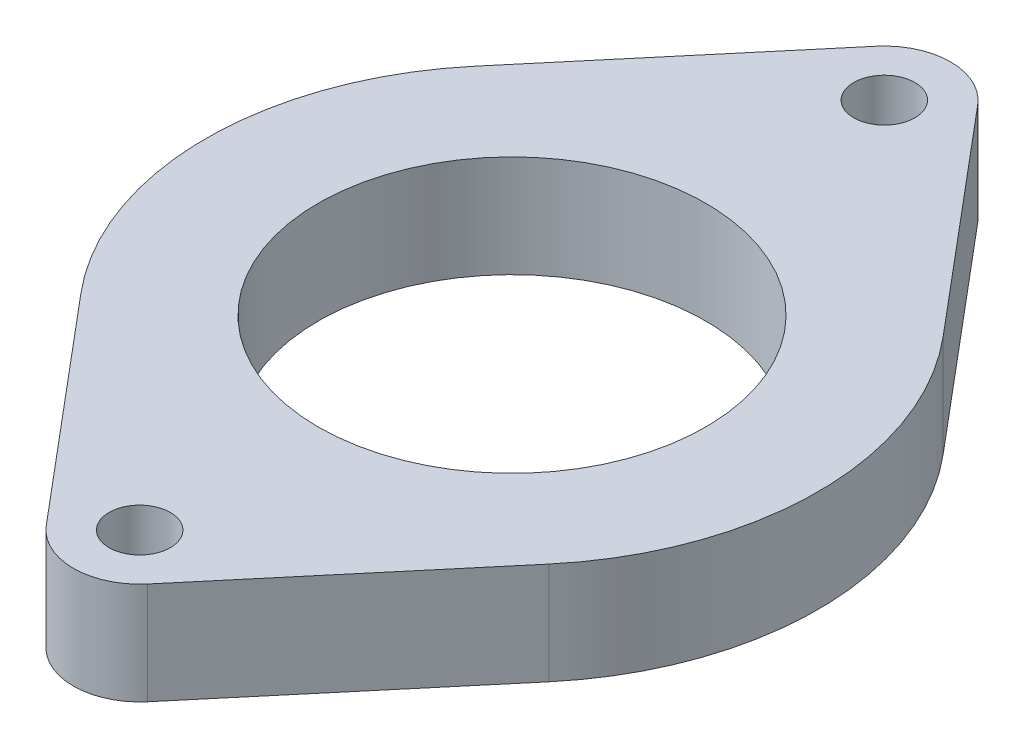
ISO-10303-21;
HEADER;
FILE_DESCRIPTION(('STEP AP214'),'2;1');
FILE_NAME('part.step','',(''),(''),'','','');
FILE_SCHEMA(('AUTOMOTIVE_DESIGN { 1 0 10303 214 1 1 1 1 }'));
ENDSEC;
DATA;
#1=APPLICATION_CONTEXT('core data for automotive mechanical design processes');
#2=APPLICATION_PROTOCOL_DEFINITION('international standard','automotive_design',2000,#1);
#3=PRODUCT_CONTEXT('',#1,'mechanical');
#4=PRODUCT('Part','Part','',(#3));
#5=PRODUCT_RELATED_PRODUCT_CATEGORY('part','',(#4));
#6=PRODUCT_DEFINITION_FORMATION('','',#4);
#7=PRODUCT_DEFINITION_CONTEXT('part definition',#1,'design');
#8=PRODUCT_DEFINITION('design','',#6,#7);
#9=PRODUCT_DEFINITION_SHAPE('','',#8);
#10=(LENGTH_UNIT() NAMED_UNIT(*) SI_UNIT(.MILLI.,.METRE.));
#11=(NAMED_UNIT(*) PLANE_ANGLE_UNIT() SI_UNIT($,.RADIAN.));
#12=(NAMED_UNIT(*) SI_UNIT($,.STERADIAN.) SOLID_ANGLE_UNIT());
#13=UNCERTAINTY_MEASURE_WITH_UNIT(LENGTH_MEASURE(1.E-05),#10,'distance_accuracy_value','');
#14=(GEOMETRIC_REPRESENTATION_CONTEXT(3) GLOBAL_UNCERTAINTY_ASSIGNED_CONTEXT((#13)) GLOBAL_UNIT_ASSIGNED_CONTEXT((#10,
#11,#12)) REPRESENTATION_CONTEXT('',''));
#15=CARTESIAN_POINT('',(0.,0.,0.));
#16=DIRECTION('',(0.,0.,1.));
#17=DIRECTION('',(1.,0.,0.));
#18=AXIS2_PLACEMENT_3D('',#15,#16,#17);
#19=CARTESIAN_POINT('',(0.,5.,0.));
#20=DIRECTION('',(0.,-1.,0.));
#21=DIRECTION('',(0.,0.,-1.));
#22=AXIS2_PLACEMENT_3D('',#19,#20,#21);
#23=CYLINDRICAL_SURFACE('',#22,15.);
#24=CARTESIAN_POINT('',(0.,0.,0.));
#25=DIRECTION('',(0.,1.,0.));
#26=DIRECTION('',(0.,0.,1.));
#27=AXIS2_PLACEMENT_3D('',#24,#25,#26);
#28=CIRCLE('',#27,15.);
#29=CARTESIAN_POINT('',(-11.477457570221,0.,-9.65753424657535));
#30=VERTEX_POINT('',#29);
#31=CARTESIAN_POINT('',(-11.4774575702211,0.,9.65753424657535));
#32=VERTEX_POINT('',#31);
#33=EDGE_CURVE('E141',#30,#32,#28,.T.);
#34=ORIENTED_EDGE('',*,*,#33,.T.);
#35=DIRECTION('',(0.,-1.,0.));
#36=VECTOR('',#35,1.);
#37=CARTESIAN_POINT('',(-11.4774575702211,5.,9.65753424657535));
#38=LINE('',#37,#36);
#39=CARTESIAN_POINT('',(-11.4774575702211,5.,9.65753424657535));
#40=VERTEX_POINT('',#39);
#41=EDGE_CURVE('E11',#40,#32,#38,.T.);
#42=ORIENTED_EDGE('',*,*,#41,.F.);
#43=CARTESIAN_POINT('',(0.,5.,0.));
#44=DIRECTION('',(0.,1.,0.));
#45=DIRECTION('',(0.,0.,1.));
#46=AXIS2_PLACEMENT_3D('',#43,#44,#45);
#47=CIRCLE('',#46,15.);
#48=CARTESIAN_POINT('',(-11.477457570221,5.,-9.65753424657535));
#49=VERTEX_POINT('',#48);
#50=EDGE_CURVE('E90',#49,#40,#47,.T.);
#51=ORIENTED_EDGE('',*,*,#50,.F.);
#52=DIRECTION('',(0.,-1.,0.));
#53=VECTOR('',#52,1.);
#54=CARTESIAN_POINT('',(-11.477457570221,5.,-9.65753424657535));
#55=LINE('',#54,#53);
#56=EDGE_CURVE('E140',#49,#30,#55,.T.);
#57=ORIENTED_EDGE('',*,*,#56,.T.);
#58=EDGE_LOOP('',(#34,#42,#51,#57));
#59=FACE_BOUND('',#58,.T.);
#60=ADVANCED_FACE('F35',(#59),#23,.T.);
#61=CARTESIAN_POINT('',(-11.4774575702211,5.,9.65753424657535));
#62=DIRECTION('',(-0.765163838014737,0.,0.643835616438356));
#63=DIRECTION('',(0.643835616438356,0.,0.765163838014737));
#64=AXIS2_PLACEMENT_3D('',#61,#62,#63);
#65=PLANE('',#64);
#66=DIRECTION('',(-0.643835616438356,0.,-0.765163838014737));
#67=VECTOR('',#66,1.);
#68=CARTESIAN_POINT('',(-11.4774575702211,0.,9.65753424657535));
#69=LINE('',#68,#67);
#70=CARTESIAN_POINT('',(-2.4867824735479,0.,20.3424657534247));
#71=VERTEX_POINT('',#70);
#72=EDGE_CURVE('E144',#71,#32,#69,.T.);
#73=ORIENTED_EDGE('',*,*,#72,.F.);
#74=DIRECTION('',(0.,-1.,0.));
#75=VECTOR('',#74,1.);
#76=CARTESIAN_POINT('',(-2.4867824735479,5.,20.3424657534247));
#77=LINE('',#76,#75);
#78=CARTESIAN_POINT('',(-2.4867824735479,5.,20.3424657534247));
#79=VERTEX_POINT('',#78);
#80=EDGE_CURVE('E43',#79,#71,#77,.T.);
#81=ORIENTED_EDGE('',*,*,#80,.F.);
#82=DIRECTION('',(-0.643835616438356,0.,-0.765163838014737));
#83=VECTOR('',#82,1.);
#84=CARTESIAN_POINT('',(-11.4774575702211,5.,9.65753424657535));
#85=LINE('',#84,#83);
#86=EDGE_CURVE('E376',#79,#40,#85,.T.);
#87=ORIENTED_EDGE('',*,*,#86,.T.);
#88=ORIENTED_EDGE('',*,*,#41,.T.);
#89=EDGE_LOOP('',(#73,#81,#87,#88));
#90=FACE_BOUND('',#89,.T.);
#91=ADVANCED_FACE('F183',(#90),#65,.T.);
#92=CARTESIAN_POINT('',(0.,5.,18.25));
#93=DIRECTION('',(0.,-1.,0.));
#94=DIRECTION('',(0.,0.,-1.));
#95=AXIS2_PLACEMENT_3D('',#92,#93,#94);
#96=CYLINDRICAL_SURFACE('',#95,3.25);
#97=CARTESIAN_POINT('',(0.,0.,18.25));
#98=DIRECTION('',(0.,1.,0.));
#99=DIRECTION('',(0.,0.,1.));
#100=AXIS2_PLACEMENT_3D('',#97,#98,#99);
#101=CIRCLE('',#100,3.25);
#102=CARTESIAN_POINT('',(2.4867824735479,0.,20.3424657534247));
#103=VERTEX_POINT('',#102);
#104=EDGE_CURVE('E147',#103,#71,#101,.F.);
#105=ORIENTED_EDGE('',*,*,#104,.F.);
#106=DIRECTION('',(0.,-1.,0.));
#107=VECTOR('',#106,1.);
#108=CARTESIAN_POINT('',(2.4867824735479,5.,20.3424657534247));
#109=LINE('',#108,#107);
#110=CARTESIAN_POINT('',(2.4867824735479,5.,20.3424657534247));
#111=VERTEX_POINT('',#110);
#112=EDGE_CURVE('E173',#111,#103,#109,.T.);
#113=ORIENTED_EDGE('',*,*,#112,.F.);
#114=CARTESIAN_POINT('',(0.,5.,18.25));
#115=DIRECTION('',(0.,1.,0.));
#116=DIRECTION('',(0.,0.,1.));
#117=AXIS2_PLACEMENT_3D('',#114,#115,#116);
#118=CIRCLE('',#117,3.25);
#119=EDGE_CURVE('E180',#111,#79,#118,.F.);
#120=ORIENTED_EDGE('',*,*,#119,.T.);
#121=ORIENTED_EDGE('',*,*,#80,.T.);
#122=EDGE_LOOP('',(#105,#113,#120,#121));
#123=FACE_BOUND('',#122,.T.);
#124=ADVANCED_FACE('F178',(#123),#96,.T.);
#125=CARTESIAN_POINT('',(11.4774575702211,5.,9.65753424657535));
#126=DIRECTION('',(-0.765163838014737,0.,-0.643835616438356));
#127=DIRECTION('',(-0.643835616438356,0.,0.765163838014737));
#128=AXIS2_PLACEMENT_3D('',#125,#126,#127);
#129=PLANE('',#128);
#130=DIRECTION('',(0.643835616438356,0.,-0.765163838014737));
#131=VECTOR('',#130,1.);
#132=CARTESIAN_POINT('',(11.4774575702211,0.,9.65753424657535));
#133=LINE('',#132,#131);
#134=CARTESIAN_POINT('',(11.4774575702211,0.,9.65753424657535));
#135=VERTEX_POINT('',#134);
#136=EDGE_CURVE('E150',#103,#135,#133,.T.);
#137=ORIENTED_EDGE('',*,*,#136,.T.);
#138=DIRECTION('',(0.,-1.,0.));
#139=VECTOR('',#138,1.);
#140=CARTESIAN_POINT('',(11.4774575702211,5.,9.65753424657535));
#141=LINE('',#140,#139);
#142=CARTESIAN_POINT('',(11.4774575702211,5.,9.65753424657535));
#143=VERTEX_POINT('',#142);
#144=EDGE_CURVE('E170',#143,#135,#141,.T.);
#145=ORIENTED_EDGE('',*,*,#144,.F.);
#146=DIRECTION('',(0.643835616438356,0.,-0.765163838014737));
#147=VECTOR('',#146,1.);
#148=CARTESIAN_POINT('',(11.4774575702211,5.,9.65753424657535));
#149=LINE('',#148,#147);
#150=EDGE_CURVE('E126',#111,#143,#149,.T.);
#151=ORIENTED_EDGE('',*,*,#150,.F.);
#152=ORIENTED_EDGE('',*,*,#112,.T.);
#153=EDGE_LOOP('',(#137,#145,#151,#152));
#154=FACE_BOUND('',#153,.T.);
#155=ADVANCED_FACE('F192',(#154),#129,.F.);
#156=CARTESIAN_POINT('',(0.,5.,0.));
#157=DIRECTION('',(0.,-1.,0.));
#158=DIRECTION('',(0.,0.,-1.));
#159=AXIS2_PLACEMENT_3D('',#156,#157,#158);
#160=CYLINDRICAL_SURFACE('',#159,15.);
#161=CARTESIAN_POINT('',(0.,0.,0.));
#162=DIRECTION('',(0.,1.,0.));
#163=DIRECTION('',(0.,0.,1.));
#164=AXIS2_PLACEMENT_3D('',#161,#162,#163);
#165=CIRCLE('',#164,15.);
#166=CARTESIAN_POINT('',(11.477457570221,0.,-9.65753424657535));
#167=VERTEX_POINT('',#166);
#168=EDGE_CURVE('E152',#135,#167,#165,.T.);
#169=ORIENTED_EDGE('',*,*,#168,.T.);
#170=DIRECTION('',(0.,-1.,0.));
#171=VECTOR('',#170,1.);
#172=CARTESIAN_POINT('',(11.477457570221,5.,-9.65753424657535));
#173=LINE('',#172,#171);
#174=CARTESIAN_POINT('',(11.477457570221,5.,-9.65753424657535));
#175=VERTEX_POINT('',#174);
#176=EDGE_CURVE('E114',#175,#167,#173,.T.);
#177=ORIENTED_EDGE('',*,*,#176,.F.);
#178=CARTESIAN_POINT('',(0.,5.,0.));
#179=DIRECTION('',(0.,1.,0.));
#180=DIRECTION('',(0.,0.,1.));
#181=AXIS2_PLACEMENT_3D('',#178,#179,#180);
#182=CIRCLE('',#181,15.);
#183=EDGE_CURVE('E123',#143,#175,#182,.T.);
#184=ORIENTED_EDGE('',*,*,#183,.F.);
#185=ORIENTED_EDGE('',*,*,#144,.T.);
#186=EDGE_LOOP('',(#169,#177,#184,#185));
#187=FACE_BOUND('',#186,.T.);
#188=ADVANCED_FACE('F195',(#187),#160,.T.);
#189=CARTESIAN_POINT('',(11.4774575702211,5.,-9.65753424657535));
#190=DIRECTION('',(0.765163838014736,0.,-0.643835616438356));
#191=DIRECTION('',(-0.643835616438356,0.,-0.765163838014737));
#192=AXIS2_PLACEMENT_3D('',#189,#190,#191);
#193=PLANE('',#192);
#194=DIRECTION('',(0.643835616438356,0.,0.765163838014736));
#195=VECTOR('',#194,1.);
#196=CARTESIAN_POINT('',(11.4774575702211,0.,-9.65753424657535));
#197=LINE('',#196,#195);
#198=CARTESIAN_POINT('',(2.48678247354789,0.,-20.3424657534247));
#199=VERTEX_POINT('',#198);
#200=EDGE_CURVE('E113',#199,#167,#197,.T.);
#201=ORIENTED_EDGE('',*,*,#200,.F.);
#202=DIRECTION('',(0.,-1.,0.));
#203=VECTOR('',#202,1.);
#204=CARTESIAN_POINT('',(2.48678247354789,5.,-20.3424657534247));
#205=LINE('',#204,#203);
#206=CARTESIAN_POINT('',(2.48678247354789,5.,-20.3424657534247));
#207=VERTEX_POINT('',#206);
#208=EDGE_CURVE('E107',#207,#199,#205,.T.);
#209=ORIENTED_EDGE('',*,*,#208,.F.);
#210=DIRECTION('',(0.643835616438356,0.,0.765163838014736));
#211=VECTOR('',#210,1.);
#212=CARTESIAN_POINT('',(11.4774575702211,5.,-9.65753424657535));
#213=LINE('',#212,#211);
#214=EDGE_CURVE('E111',#207,#175,#213,.T.);
#215=ORIENTED_EDGE('',*,*,#214,.T.);
#216=ORIENTED_EDGE('',*,*,#176,.T.);
#217=EDGE_LOOP('',(#201,#209,#215,#216));
#218=FACE_BOUND('',#217,.T.);
#219=ADVANCED_FACE('F109',(#218),#193,.T.);
#220=CARTESIAN_POINT('',(0.,5.,-18.25));
#221=DIRECTION('',(0.,-1.,0.));
#222=DIRECTION('',(0.,0.,-1.));
#223=AXIS2_PLACEMENT_3D('',#220,#221,#222);
#224=CYLINDRICAL_SURFACE('',#223,3.25);
#225=CARTESIAN_POINT('',(0.,0.,-18.25));
#226=DIRECTION('',(0.,1.,0.));
#227=DIRECTION('',(0.,0.,1.));
#228=AXIS2_PLACEMENT_3D('',#225,#226,#227);
#229=CIRCLE('',#228,3.25);
#230=CARTESIAN_POINT('',(-2.48678247354789,0.,-20.3424657534247));
#231=VERTEX_POINT('',#230);
#232=EDGE_CURVE('E78',#199,#231,#229,.T.);
#233=ORIENTED_EDGE('',*,*,#232,.T.);
#234=DIRECTION('',(0.,-1.,0.));
#235=VECTOR('',#234,1.);
#236=CARTESIAN_POINT('',(-2.48678247354789,5.,-20.3424657534247));
#237=LINE('',#236,#235);
#238=CARTESIAN_POINT('',(-2.48678247354789,5.,-20.3424657534247));
#239=VERTEX_POINT('',#238);
#240=EDGE_CURVE('E115',#239,#231,#237,.T.);
#241=ORIENTED_EDGE('',*,*,#240,.F.);
#242=CARTESIAN_POINT('',(0.,5.,-18.25));
#243=DIRECTION('',(0.,1.,0.));
#244=DIRECTION('',(0.,0.,1.));
#245=AXIS2_PLACEMENT_3D('',#242,#243,#244);
#246=CIRCLE('',#245,3.25);
#247=EDGE_CURVE('E117',#207,#239,#246,.T.);
#248=ORIENTED_EDGE('',*,*,#247,.F.);
#249=ORIENTED_EDGE('',*,*,#208,.T.);
#250=EDGE_LOOP('',(#233,#241,#248,#249));
#251=FACE_BOUND('',#250,.T.);
#252=ADVANCED_FACE('F118',(#251),#224,.T.);
#253=CARTESIAN_POINT('',(0.,5.,18.25));
#254=DIRECTION('',(0.,-1.,0.));
#255=DIRECTION('',(0.,0.,-1.));
#256=AXIS2_PLACEMENT_3D('',#253,#254,#255);
#257=CYLINDRICAL_SURFACE('',#256,1.5);
#258=CARTESIAN_POINT('',(0.,5.,18.25));
#259=DIRECTION('',(0.,1.,0.));
#260=DIRECTION('',(0.,0.,1.));
#261=AXIS2_PLACEMENT_3D('',#258,#259,#260);
#262=CIRCLE('',#261,1.5);
#263=CARTESIAN_POINT('',(0.,5.,19.75));
#264=VERTEX_POINT('',#263);
#265=EDGE_CURVE('E134',#264,#264,#262,.F.);
#266=ORIENTED_EDGE('',*,*,#265,.F.);
#267=EDGE_LOOP('',(#266));
#268=FACE_BOUND('',#267,.T.);
#269=CARTESIAN_POINT('',(0.,0.,18.25));
#270=DIRECTION('',(0.,1.,0.));
#271=DIRECTION('',(0.,0.,1.));
#272=AXIS2_PLACEMENT_3D('',#269,#270,#271);
#273=CIRCLE('',#272,1.5);
#274=CARTESIAN_POINT('',(0.,0.,19.75));
#275=VERTEX_POINT('',#274);
#276=EDGE_CURVE('E161',#275,#275,#273,.F.);
#277=ORIENTED_EDGE('',*,*,#276,.T.);
#278=EDGE_LOOP('',(#277));
#279=FACE_BOUND('',#278,.T.);
#280=ADVANCED_FACE('F208',(#268,#279),#257,.F.);
#281=CARTESIAN_POINT('',(0.,5.,0.));
#282=DIRECTION('',(0.,-1.,0.));
#283=DIRECTION('',(0.,0.,-1.));
#284=AXIS2_PLACEMENT_3D('',#281,#282,#283);
#285=CYLINDRICAL_SURFACE('',#284,9.5);
#286=CARTESIAN_POINT('',(0.,5.,0.));
#287=DIRECTION('',(0.,1.,0.));
#288=DIRECTION('',(0.,0.,1.));
#289=AXIS2_PLACEMENT_3D('',#286,#287,#288);
#290=CIRCLE('',#289,9.5);
#291=CARTESIAN_POINT('',(0.,5.,9.5));
#292=VERTEX_POINT('',#291);
#293=EDGE_CURVE('E131',#292,#292,#290,.T.);
#294=ORIENTED_EDGE('',*,*,#293,.T.);
#295=EDGE_LOOP('',(#294));
#296=FACE_BOUND('',#295,.T.);
#297=CARTESIAN_POINT('',(0.,0.,0.));
#298=DIRECTION('',(0.,1.,0.));
#299=DIRECTION('',(0.,0.,1.));
#300=AXIS2_PLACEMENT_3D('',#297,#298,#299);
#301=CIRCLE('',#300,9.5);
#302=CARTESIAN_POINT('',(0.,0.,9.5));
#303=VERTEX_POINT('',#302);
#304=EDGE_CURVE('E158',#303,#303,#301,.T.);
#305=ORIENTED_EDGE('',*,*,#304,.F.);
#306=EDGE_LOOP('',(#305));
#307=FACE_BOUND('',#306,.T.);
#308=ADVANCED_FACE('F200',(#296,#307),#285,.F.);
#309=CARTESIAN_POINT('',(-11.4774575702211,5.,-9.65753424657535));
#310=DIRECTION('',(0.765163838014736,0.,0.643835616438356));
#311=DIRECTION('',(0.643835616438356,0.,-0.765163838014737));
#312=AXIS2_PLACEMENT_3D('',#309,#310,#311);
#313=PLANE('',#312);
#314=DIRECTION('',(-0.643835616438356,0.,0.765163838014736));
#315=VECTOR('',#314,1.);
#316=CARTESIAN_POINT('',(-11.4774575702211,0.,-9.65753424657535));
#317=LINE('',#316,#315);
#318=EDGE_CURVE('E84',#231,#30,#317,.T.);
#319=ORIENTED_EDGE('',*,*,#318,.T.);
#320=ORIENTED_EDGE('',*,*,#56,.F.);
#321=DIRECTION('',(-0.643835616438356,0.,0.765163838014736));
#322=VECTOR('',#321,1.);
#323=CARTESIAN_POINT('',(-11.4774575702211,5.,-9.65753424657535));
#324=LINE('',#323,#322);
#325=EDGE_CURVE('E51',#239,#49,#324,.T.);
#326=ORIENTED_EDGE('',*,*,#325,.F.);
#327=ORIENTED_EDGE('',*,*,#240,.T.);
#328=EDGE_LOOP('',(#319,#320,#326,#327));
#329=FACE_BOUND('',#328,.T.);
#330=ADVANCED_FACE('F197',(#329),#313,.F.);
#331=CARTESIAN_POINT('',(0.,5.,-18.25));
#332=DIRECTION('',(0.,-1.,0.));
#333=DIRECTION('',(0.,0.,-1.));
#334=AXIS2_PLACEMENT_3D('',#331,#332,#333);
#335=CYLINDRICAL_SURFACE('',#334,1.5);
#336=CARTESIAN_POINT('',(0.,5.,-18.25));
#337=DIRECTION('',(0.,1.,0.));
#338=DIRECTION('',(0.,0.,1.));
#339=AXIS2_PLACEMENT_3D('',#336,#337,#338);
#340=CIRCLE('',#339,1.5);
#341=CARTESIAN_POINT('',(0.,5.,-16.75));
#342=VERTEX_POINT('',#341);
#343=EDGE_CURVE('E137',#342,#342,#340,.T.);
#344=ORIENTED_EDGE('',*,*,#343,.T.);
#345=EDGE_LOOP('',(#344));
#346=FACE_BOUND('',#345,.T.);
#347=CARTESIAN_POINT('',(0.,0.,-18.25));
#348=DIRECTION('',(0.,1.,0.));
#349=DIRECTION('',(0.,0.,1.));
#350=AXIS2_PLACEMENT_3D('',#347,#348,#349);
#351=CIRCLE('',#350,1.5);
#352=CARTESIAN_POINT('',(0.,0.,-16.75));
#353=VERTEX_POINT('',#352);
#354=EDGE_CURVE('E164',#353,#353,#351,.T.);
#355=ORIENTED_EDGE('',*,*,#354,.F.);
#356=EDGE_LOOP('',(#355));
#357=FACE_BOUND('',#356,.T.);
#358=ADVANCED_FACE('F199',(#346,#357),#335,.F.);
#359=CARTESIAN_POINT('',(0.,5.,0.));
#360=DIRECTION('',(0.,1.,0.));
#361=DIRECTION('',(0.,0.,1.));
#362=AXIS2_PLACEMENT_3D('',#359,#360,#361);
#363=PLANE('',#362);
#364=ORIENTED_EDGE('',*,*,#50,.T.);
#365=ORIENTED_EDGE('',*,*,#86,.F.);
#366=ORIENTED_EDGE('',*,*,#119,.F.);
#367=ORIENTED_EDGE('',*,*,#150,.T.);
#368=ORIENTED_EDGE('',*,*,#183,.T.);
#369=ORIENTED_EDGE('',*,*,#214,.F.);
#370=ORIENTED_EDGE('',*,*,#247,.T.);
#371=ORIENTED_EDGE('',*,*,#325,.T.);
#372=EDGE_LOOP('',(#364,#365,#366,#367,#368,#369,#370,#371));
#373=FACE_BOUND('',#372,.T.);
#374=ORIENTED_EDGE('',*,*,#293,.F.);
#375=EDGE_LOOP('',(#374));
#376=FACE_BOUND('',#375,.T.);
#377=ORIENTED_EDGE('',*,*,#265,.T.);
#378=EDGE_LOOP('',(#377));
#379=FACE_BOUND('',#378,.T.);
#380=ORIENTED_EDGE('',*,*,#343,.F.);
#381=EDGE_LOOP('',(#380));
#382=FACE_BOUND('',#381,.T.);
#383=ADVANCED_FACE('F120',(#373,#376,#379,#382),#363,.T.);
#384=CARTESIAN_POINT('',(0.,0.,0.));
#385=DIRECTION('',(0.,1.,0.));
#386=DIRECTION('',(0.,0.,1.));
#387=AXIS2_PLACEMENT_3D('',#384,#385,#386);
#388=PLANE('',#387);
#389=ORIENTED_EDGE('',*,*,#33,.F.);
#390=ORIENTED_EDGE('',*,*,#318,.F.);
#391=ORIENTED_EDGE('',*,*,#232,.F.);
#392=ORIENTED_EDGE('',*,*,#200,.T.);
#393=ORIENTED_EDGE('',*,*,#168,.F.);
#394=ORIENTED_EDGE('',*,*,#136,.F.);
#395=ORIENTED_EDGE('',*,*,#104,.T.);
#396=ORIENTED_EDGE('',*,*,#72,.T.);
#397=EDGE_LOOP('',(#389,#390,#391,#392,#393,#394,#395,#396));
#398=FACE_BOUND('',#397,.T.);
#399=ORIENTED_EDGE('',*,*,#304,.T.);
#400=EDGE_LOOP('',(#399));
#401=FACE_BOUND('',#400,.T.);
#402=ORIENTED_EDGE('',*,*,#276,.F.);
#403=EDGE_LOOP('',(#402));
#404=FACE_BOUND('',#403,.T.);
#405=ORIENTED_EDGE('',*,*,#354,.T.);
#406=EDGE_LOOP('',(#405));
#407=FACE_BOUND('',#406,.T.);
#408=ADVANCED_FACE('F187',(#398,#401,#404,#407),#388,.F.);
#409=CLOSED_SHELL('',(#60,#91,#124,#155,#188,#219,#252,#280,#308,#330,#358,#383,#408));
#410=MANIFOLD_SOLID_BREP('B2',#409);
#411=ADVANCED_BREP_SHAPE_REPRESENTATION('',(#18,#410),#14);
#412=SHAPE_DEFINITION_REPRESENTATION(#9,#411);
ENDSEC;
END-ISO-10303-21;
